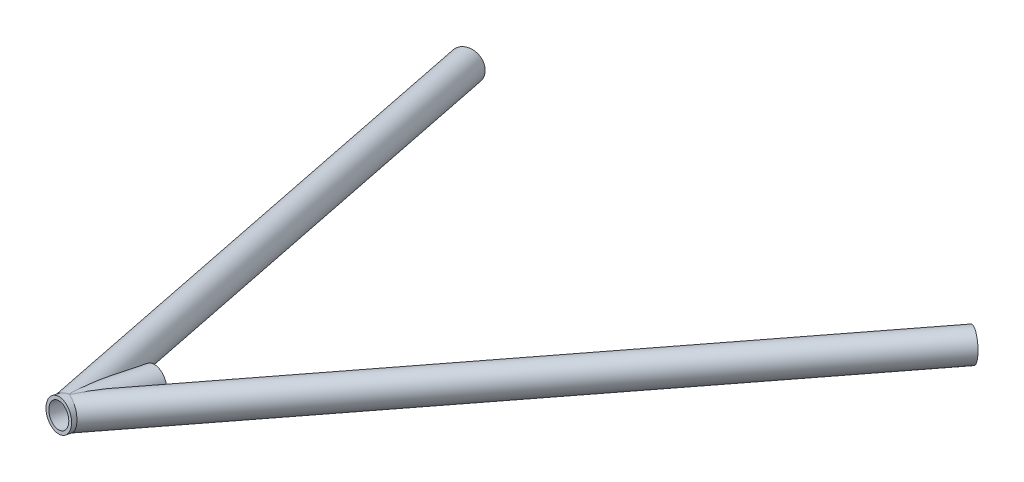
ISO-10303-21;
HEADER;
FILE_DESCRIPTION(('STEP AP214'),'2;1');
FILE_NAME('part.step','',(''),(''),'','','');
FILE_SCHEMA(('AUTOMOTIVE_DESIGN { 1 0 10303 214 1 1 1 1 }'));
ENDSEC;
DATA;
#1=APPLICATION_CONTEXT('core data for automotive mechanical design processes');
#2=APPLICATION_PROTOCOL_DEFINITION('international standard','automotive_design',2000,#1);
#3=PRODUCT_CONTEXT('',#1,'mechanical');
#4=PRODUCT('Part','Part','',(#3));
#5=PRODUCT_RELATED_PRODUCT_CATEGORY('part','',(#4));
#6=PRODUCT_DEFINITION_FORMATION('','',#4);
#7=PRODUCT_DEFINITION_CONTEXT('part definition',#1,'design');
#8=PRODUCT_DEFINITION('design','',#6,#7);
#9=PRODUCT_DEFINITION_SHAPE('','',#8);
#10=(LENGTH_UNIT() NAMED_UNIT(*) SI_UNIT(.MILLI.,.METRE.));
#11=(NAMED_UNIT(*) PLANE_ANGLE_UNIT() SI_UNIT($,.RADIAN.));
#12=(NAMED_UNIT(*) SI_UNIT($,.STERADIAN.) SOLID_ANGLE_UNIT());
#13=UNCERTAINTY_MEASURE_WITH_UNIT(LENGTH_MEASURE(1.E-05),#10,'distance_accuracy_value','');
#14=(GEOMETRIC_REPRESENTATION_CONTEXT(3) GLOBAL_UNCERTAINTY_ASSIGNED_CONTEXT((#13)) GLOBAL_UNIT_ASSIGNED_CONTEXT((#10,
#11,#12)) REPRESENTATION_CONTEXT('',''));
#15=CARTESIAN_POINT('',(0.,0.,0.));
#16=DIRECTION('',(0.,0.,1.));
#17=DIRECTION('',(1.,0.,0.));
#18=AXIS2_PLACEMENT_3D('',#15,#16,#17);
#19=CARTESIAN_POINT('',(1713.17260085528,131.13395858879,611.724588998966));
#20=DIRECTION('',(0.512976736373104,-0.08229223970805,-0.854448860508241));
#21=DIRECTION('',(-0.857356807637054,0.,-0.514722550893585));
#22=AXIS2_PLACEMENT_3D('',#19,#20,#21);
#23=CYLINDRICAL_SURFACE('',#22,7.41679999999994);
#24=CARTESIAN_POINT('',(1932.04581422694,96.022099388704,247.154513007892));
#25=DIRECTION('',(-0.512976736373104,0.0822922397080499,0.854448860508241));
#26=DIRECTION('',(0.857356807637054,0.,0.514722550893586));
#27=AXIS2_PLACEMENT_3D('',#24,#25,#26);
#28=CIRCLE('',#27,7.41679999999994);
#29=CARTESIAN_POINT('',(1938.40465819782,96.022099388704,250.972107223359));
#30=VERTEX_POINT('',#29);
#31=EDGE_CURVE('E109',#30,#30,#28,.T.);
#32=ORIENTED_EDGE('',*,*,#31,.F.);
#33=EDGE_LOOP('',(#32));
#34=FACE_BOUND('',#33,.T.);
#35=CARTESIAN_POINT('',(1727.96494727041,127.740863530205,572.676136847325));
#36=CARTESIAN_POINT('',(1727.97409356128,127.64516894431,572.660902269402));
#37=CARTESIAN_POINT('',(1727.98103211846,127.548097206245,572.652833381433));
#38=CARTESIAN_POINT('',(1727.98986205941,127.353714048548,572.652650921007));
#39=CARTESIAN_POINT('',(1727.9917570845,127.256402852634,572.660525830246));
#40=CARTESIAN_POINT('',(1727.9903865827,127.064536165254,572.692160774698));
#41=CARTESIAN_POINT('',(1727.98712459409,126.96997882967,572.715909912043));
#42=CARTESIAN_POINT('',(1727.97590682349,126.785874735888,572.777508555146));
#43=CARTESIAN_POINT('',(1727.96794614816,126.69633330799,572.81537274554));
#44=CARTESIAN_POINT('',(1727.94374603927,126.485559074002,572.921757086013));
#45=CARTESIAN_POINT('',(1727.92540545642,126.367705556888,572.996436012294));
#46=CARTESIAN_POINT('',(1727.88298827099,126.145253912992,573.162093992202));
#47=CARTESIAN_POINT('',(1727.85889597553,126.040693271732,573.253117468602));
#48=CARTESIAN_POINT('',(1727.80874896439,125.850776346686,573.438738015154));
#49=CARTESIAN_POINT('',(1727.78297627403,125.764568317802,573.532557144889));
#50=CARTESIAN_POINT('',(1727.72900511059,125.600664094481,573.726773439114));
#51=CARTESIAN_POINT('',(1727.70080438425,125.522975962023,573.827176692751));
#52=CARTESIAN_POINT('',(1727.64258111377,125.374671581661,574.032881151348));
#53=CARTESIAN_POINT('',(1727.61255461953,125.304071611508,574.138192852058));
#54=CARTESIAN_POINT('',(1727.55119302126,125.169051291257,574.352237356395));
#55=CARTESIAN_POINT('',(1727.51985847234,125.10462835719,574.460968704016));
#56=CARTESIAN_POINT('',(1727.43550937838,124.940862556696,574.75250380522));
#57=CARTESIAN_POINT('',(1727.38162646562,124.846001418485,574.937569357596));
#58=CARTESIAN_POINT('',(1727.2720160663,124.667387845638,575.312498085115));
#59=CARTESIAN_POINT('',(1727.21628751957,124.583641939115,575.502364002333));
#60=CARTESIAN_POINT('',(1727.10344674438,124.42503329062,575.885807049649));
#61=CARTESIAN_POINT('',(1727.04633202635,124.350188215227,576.079390703019));
#62=CARTESIAN_POINT('',(1726.93118633598,124.208006874476,576.469032465374));
#63=CARTESIAN_POINT('',(1726.87315525579,124.140671500554,576.665090865056));
#64=CARTESIAN_POINT('',(1726.75607151227,124.011958347827,577.060302103558));
#65=CARTESIAN_POINT('',(1726.69701473252,123.950620396564,577.259466620516));
#66=CARTESIAN_POINT('',(1726.57842016781,123.833477246945,577.659275794955));
#67=CARTESIAN_POINT('',(1726.51888236167,123.777672293717,577.859920517589));
#68=CARTESIAN_POINT('',(1726.39955647189,123.670971354545,578.262089610324));
#69=CARTESIAN_POINT('',(1726.33976888635,123.620068255865,578.463612248458));
#70=CARTESIAN_POINT('',(1726.21996664204,123.522526106761,578.867609532447));
#71=CARTESIAN_POINT('',(1726.15995198776,123.475886972416,579.070084159484));
#72=CARTESIAN_POINT('',(1725.97675549558,123.339471254847,579.68863525574));
#73=CARTESIAN_POINT('',(1725.8533478987,123.255762125754,580.105988788057));
#74=CARTESIAN_POINT('',(1725.60651921912,123.101361297342,580.943114963038));
#75=CARTESIAN_POINT('',(1725.48309813691,123.030671398123,581.362887931962));
#76=CARTESIAN_POINT('',(1725.23663397589,122.900298304971,582.204465381431));
#77=CARTESIAN_POINT('',(1725.11359110923,122.840620461465,582.626270747865));
#78=CARTESIAN_POINT('',(1724.86832131163,122.730861979163,583.471367521118));
#79=CARTESIAN_POINT('',(1724.74609440437,122.680781617954,583.894658970559));
#80=CARTESIAN_POINT('',(1724.5023773004,122.58898911596,584.744026957329));
#81=CARTESIAN_POINT('',(1724.38089135839,122.547307849537,585.170108032062));
#82=CARTESIAN_POINT('',(1724.13946845727,122.471741006267,586.023400168488));
#83=CARTESIAN_POINT('',(1724.01953151574,122.437855517866,586.450611242946));
#84=CARTESIAN_POINT('',(1723.78164336913,122.37730603995,587.305929188253));
#85=CARTESIAN_POINT('',(1723.66369146931,122.350639472405,587.734035684142));
#86=CARTESIAN_POINT('',(1723.43017032018,122.304100261973,588.591265690762));
#87=CARTESIAN_POINT('',(1723.31460107086,122.284227619046,589.020389201487));
#88=CARTESIAN_POINT('',(1723.08650301183,122.251038204343,589.879111158263));
#89=CARTESIAN_POINT('',(1722.97397051875,122.237713118719,590.308708304211));
#90=CARTESIAN_POINT('',(1722.75240223065,122.21746804288,591.168958885652));
#91=CARTESIAN_POINT('',(1722.6433664605,122.210548098208,591.599612328634));
#92=CARTESIAN_POINT('',(1722.4294841374,122.203151370928,592.462242442208));
#93=CARTESIAN_POINT('',(1722.32463967907,122.202677770736,592.894219661074));
#94=CARTESIAN_POINT('',(1722.12012673583,122.208397768749,593.759351670043));
#95=CARTESIAN_POINT('',(1722.02045816112,122.214591251234,594.192506439578));
#96=CARTESIAN_POINT('',(1721.82784497984,122.234044047694,595.058398596565));
#97=CARTESIAN_POINT('',(1721.73487583636,122.247275914712,595.49113110808));
#98=CARTESIAN_POINT('',(1721.55672743593,122.281510622887,596.357943907328));
#99=CARTESIAN_POINT('',(1721.47154880266,122.302514085519,596.792024300095));
#100=CARTESIAN_POINT('',(1721.31101479407,122.35340281984,597.661126705699));
#101=CARTESIAN_POINT('',(1721.23565138308,122.383280759445,598.096147648058));
#102=CARTESIAN_POINT('',(1721.09725075453,122.453629781079,598.967260132079));
#103=CARTESIAN_POINT('',(1721.03421072045,122.49409843764,599.40335140599));
#104=CARTESIAN_POINT('',(1720.95141843917,122.564800761776,600.058504181435));
#105=CARTESIAN_POINT('',(1720.92575512113,122.590076478741,600.27735975769));
#106=CARTESIAN_POINT('',(1720.87894799292,122.644429538069,600.715097811308));
#107=CARTESIAN_POINT('',(1720.85780430852,122.673506986186,600.933980289252));
#108=CARTESIAN_POINT('',(1720.82063639031,122.736046756599,601.37177018042));
#109=CARTESIAN_POINT('',(1720.80461691278,122.769513112292,601.590677429229));
#110=CARTESIAN_POINT('',(1720.77843177853,122.841500800809,602.0280190367));
#111=CARTESIAN_POINT('',(1720.76826600443,122.880022032265,602.246453404756));
#112=CARTESIAN_POINT('',(1720.75464236975,122.962578180945,602.680391994006));
#113=CARTESIAN_POINT('',(1720.75112283815,123.006558329871,602.895904544071));
#114=CARTESIAN_POINT('',(1720.75144146033,123.101309930987,603.32547198744));
#115=CARTESIAN_POINT('',(1720.75528034475,123.152082057095,603.539526733878));
#116=CARTESIAN_POINT('',(1720.77117314224,123.261516067903,603.964991352626));
#117=CARTESIAN_POINT('',(1720.78321484223,123.320166119178,604.176404681827));
#118=CARTESIAN_POINT('',(1720.81632130453,123.44675439699,604.595673975282));
#119=CARTESIAN_POINT('',(1720.83738269157,123.514689142633,604.803531240023));
#120=CARTESIAN_POINT('',(1720.88654176997,123.653870902915,605.193228073523));
#121=CARTESIAN_POINT('',(1720.91370135907,123.724071338384,605.375557052368));
#122=CARTESIAN_POINT('',(1720.97607889913,123.874300330305,605.734729463356));
#123=CARTESIAN_POINT('',(1721.01129627704,123.954328187649,605.911573284585));
#124=CARTESIAN_POINT('',(1721.08971062154,124.125271923741,606.258131687802));
#125=CARTESIAN_POINT('',(1721.13290784645,124.216188154927,606.427846038781));
#126=CARTESIAN_POINT('',(1721.22674446288,124.409769775465,606.758314823208));
#127=CARTESIAN_POINT('',(1721.27738376908,124.512435030114,606.919069359348));
#128=CARTESIAN_POINT('',(1721.3855072529,124.730994984514,607.23111948081));
#129=CARTESIAN_POINT('',(1721.44304636173,124.846995500896,607.382322217059));
#130=CARTESIAN_POINT('',(1721.56300771482,125.091639689068,607.67205382739));
#131=CARTESIAN_POINT('',(1721.62542999899,125.220283464155,607.810582597906));
#132=CARTESIAN_POINT('',(1721.75315143352,125.489914923755,608.073651978261));
#133=CARTESIAN_POINT('',(1721.81845111264,125.630904881767,608.19819000208));
#134=CARTESIAN_POINT('',(1721.94968124855,125.924479370239,608.432366170017));
#135=CARTESIAN_POINT('',(1722.01561167772,126.077063394983,608.542004963434));
#136=CARTESIAN_POINT('',(1722.13955526978,126.377509450479,608.736096590528));
#137=CARTESIAN_POINT('',(1722.19771779669,126.524402700009,608.821959461154));
#138=CARTESIAN_POINT('',(1722.31116511023,126.825880386425,608.981134975396));
#139=CARTESIAN_POINT('',(1722.3664501127,126.980464244723,609.054448561295));
#140=CARTESIAN_POINT('',(1722.47275540199,127.296365032461,609.188669150145));
#141=CARTESIAN_POINT('',(1722.5237749461,127.457683127195,609.249573995075));
#142=CARTESIAN_POINT('',(1722.62033165225,127.785999443879,609.359205215786));
#143=CARTESIAN_POINT('',(1722.66586857487,127.952997913477,609.407931059826));
#144=CARTESIAN_POINT('',(1722.75164172524,128.29640418743,609.494706477049));
#145=CARTESIAN_POINT('',(1722.79169181994,128.472944530114,609.532415478967));
#146=CARTESIAN_POINT('',(1722.8640371505,128.829759443344,609.595601504443));
#147=CARTESIAN_POINT('',(1722.89633232043,129.010034045622,609.621078424016));
#148=CARTESIAN_POINT('',(1722.95249148233,129.373186473069,609.660119630804));
#149=CARTESIAN_POINT('',(1722.97635454316,129.556064583422,609.673682602619));
#150=CARTESIAN_POINT('',(1723.01515818182,129.923256038395,609.689169544628));
#151=CARTESIAN_POINT('',(1723.03009848552,130.107569426933,609.691093157246));
#152=CARTESIAN_POINT('',(1723.05126111044,130.48562374927,609.68334006981));
#153=CARTESIAN_POINT('',(1723.05701489795,130.679379398514,609.673083994552));
#154=CARTESIAN_POINT('',(1723.05820730972,131.065873045047,609.640194907813));
#155=CARTESIAN_POINT('',(1723.05364558616,131.258611007804,609.617561479028));
#156=CARTESIAN_POINT('',(1723.0342649561,131.641770012805,609.560034321559));
#157=CARTESIAN_POINT('',(1723.01944390483,131.832190562108,609.525138030002));
#158=CARTESIAN_POINT('',(1722.97981103516,132.209328386555,609.443138314178));
#159=CARTESIAN_POINT('',(1722.95499922456,132.39604566459,609.396034899443));
#160=CARTESIAN_POINT('',(1722.89550269088,132.766703219176,609.288949001972));
#161=CARTESIAN_POINT('',(1722.86069983807,132.950580734236,609.22881466779));
#162=CARTESIAN_POINT('',(1722.78208849335,133.311748866658,609.095948257574));
#163=CARTESIAN_POINT('',(1722.73827986116,133.489039381357,609.023215985292));
#164=CARTESIAN_POINT('',(1722.64265698482,133.83559948493,608.865054832965));
#165=CARTESIAN_POINT('',(1722.59084362106,134.004869953218,608.779627349244));
#166=CARTESIAN_POINT('',(1722.48047464414,134.33400566275,608.595962018572));
#167=CARTESIAN_POINT('',(1722.4219192384,134.493871193108,608.497724565708));
#168=CARTESIAN_POINT('',(1722.30106472921,134.799174643532,608.290864804495));
#169=CARTESIAN_POINT('',(1722.23888720345,134.94486466322,608.18254370868));
#170=CARTESIAN_POINT('',(1722.11127512067,135.224795212031,607.953702361441));
#171=CARTESIAN_POINT('',(1722.04584064459,135.359036025404,607.833182413039));
#172=CARTESIAN_POINT('',(1721.91366635636,135.614930784771,607.580298333684));
#173=CARTESIAN_POINT('',(1721.84692756972,135.736594180956,607.447943236731));
#174=CARTESIAN_POINT('',(1721.71412450417,135.966639285091,607.171847178467));
#175=CARTESIAN_POINT('',(1721.64806018694,136.075021751086,607.02810686777));
#176=CARTESIAN_POINT('',(1721.52239851466,136.272116972746,606.738790542243));
#177=CARTESIAN_POINT('',(1721.46264865977,136.361607971169,606.593809785904));
#178=CARTESIAN_POINT('',(1721.34708030177,136.528344058238,606.295479899512));
#179=CARTESIAN_POINT('',(1721.29126195926,136.605588646783,606.142130428052));
#180=CARTESIAN_POINT('',(1721.18487097998,136.748087082032,605.828289022178));
#181=CARTESIAN_POINT('',(1721.1342967204,136.813344643017,605.667799319437));
#182=CARTESIAN_POINT('',(1721.0393136034,136.93250954249,605.340898347557));
#183=CARTESIAN_POINT('',(1720.99490558263,136.986415341279,605.174486278711));
#184=CARTESIAN_POINT('',(1720.89775755889,137.101612192386,604.774949400739));
#185=CARTESIAN_POINT('',(1720.84795468422,137.158334953547,604.539786197404));
#186=CARTESIAN_POINT('',(1720.761417646,137.254742564386,604.063646261449));
#187=CARTESIAN_POINT('',(1720.72468903258,137.294420179742,603.822667106151));
#188=CARTESIAN_POINT('',(1720.66371663303,137.359538683433,603.336541202226));
#189=CARTESIAN_POINT('',(1720.63951103582,137.384936044358,603.091384033362));
#190=CARTESIAN_POINT('',(1720.60272339149,137.423819425911,602.599355883453));
#191=CARTESIAN_POINT('',(1720.59013996661,137.437306858397,602.352485109045));
#192=CARTESIAN_POINT('',(1720.57337385512,137.456823568455,601.792628043288));
#193=CARTESIAN_POINT('',(1720.57230027565,137.459930016163,601.479454378519));
#194=CARTESIAN_POINT('',(1720.58417742968,137.454018409565,600.853430304954));
#195=CARTESIAN_POINT('',(1720.59713493855,137.444994497211,600.540580125412));
#196=CARTESIAN_POINT('',(1720.63480918709,137.417352784856,599.915485161843));
#197=CARTESIAN_POINT('',(1720.65954724853,137.398717584163,599.603242510398));
#198=CARTESIAN_POINT('',(1720.71882165563,137.353738420371,598.980328897369));
#199=CARTESIAN_POINT('',(1720.75335646173,137.327395668486,598.669657696635));
#200=CARTESIAN_POINT('',(1720.8308046662,137.268223698417,598.048368225909));
#201=CARTESIAN_POINT('',(1720.87376015575,137.235361884093,597.737758410564));
#202=CARTESIAN_POINT('',(1720.96659709961,137.164253235441,597.118199275331));
#203=CARTESIAN_POINT('',(1721.01647876114,137.126006240001,596.80925000541));
#204=CARTESIAN_POINT('',(1721.12202554296,137.04490868398,596.193280763136));
#205=CARTESIAN_POINT('',(1721.17768482224,137.002062771319,595.886259168724));
#206=CARTESIAN_POINT('',(1721.29394637719,136.91227202674,595.273753004626));
#207=CARTESIAN_POINT('',(1721.35454879116,136.86532708014,594.968268478198));
#208=CARTESIAN_POINT('',(1721.48689814169,136.762340022273,594.325092282613));
#209=CARTESIAN_POINT('',(1721.55913661087,136.705865864814,593.987571240588));
#210=CARTESIAN_POINT('',(1721.70800797088,136.588721327278,593.314235690565));
#211=CARTESIAN_POINT('',(1721.78464089753,136.528050913001,592.978421196498));
#212=CARTESIAN_POINT('',(1722.02015110959,136.340118035014,591.973243681679));
#213=CARTESIAN_POINT('',(1722.18461125852,136.206955959258,591.306282617483));
#214=CARTESIAN_POINT('',(1722.52380469313,135.926387101613,589.980768374029));
#215=CARTESIAN_POINT('',(1722.69849782608,135.779034703202,589.322193249398));
#216=CARTESIAN_POINT('',(1723.05598721481,135.469567694324,588.01080760164));
#217=CARTESIAN_POINT('',(1723.23878260921,135.307454651191,587.357996474529));
#218=CARTESIAN_POINT('',(1723.55452426619,135.018691715748,586.253930224215));
#219=CARTESIAN_POINT('',(1723.68590746506,134.896061424993,585.801171825454));
#220=CARTESIAN_POINT('',(1723.95111551043,134.642547833543,584.898691759351));
#221=CARTESIAN_POINT('',(1724.08494031998,134.511664657721,584.448970046175));
#222=CARTESIAN_POINT('',(1724.35467562746,134.240717304903,583.552415100005));
#223=CARTESIAN_POINT('',(1724.49058800813,134.100644416195,583.105585062221));
#224=CARTESIAN_POINT('',(1724.76392276377,133.810333225487,582.215709012982));
#225=CARTESIAN_POINT('',(1724.90134507992,133.660095318334,581.772662855299));
#226=CARTESIAN_POINT('',(1725.13303411532,133.39795288106,581.032344486458));
#227=CARTESIAN_POINT('',(1725.22701445816,133.28919715999,580.733866737919));
#228=CARTESIAN_POINT('',(1725.41531632578,133.065645250542,580.139292497245));
#229=CARTESIAN_POINT('',(1725.50963784152,132.95084922093,579.843195942756));
#230=CARTESIAN_POINT('',(1725.69835005293,132.714542685856,579.25412563389));
#231=CARTESIAN_POINT('',(1725.79274055542,132.593039779193,578.961148776507));
#232=CARTESIAN_POINT('',(1725.98149054865,132.342170423669,578.378573935822));
#233=CARTESIAN_POINT('',(1726.07585004089,132.212804440137,578.088975753778));
#234=CARTESIAN_POINT('',(1726.23385918959,131.988073989553,577.606814129099));
#235=CARTESIAN_POINT('',(1726.29758828677,131.895216124959,577.413108274243));
#236=CARTESIAN_POINT('',(1726.4248037404,131.704690541732,577.027999567039));
#237=CARTESIAN_POINT('',(1726.48829010775,131.607023041657,576.836596610536));
#238=CARTESIAN_POINT('',(1726.61505615117,131.405902201767,576.456054624089));
#239=CARTESIAN_POINT('',(1726.67833480281,131.302433918203,576.266923123393));
#240=CARTESIAN_POINT('',(1726.80431567271,131.089057563296,575.892150690148));
#241=CARTESIAN_POINT('',(1726.867017965,130.979150332607,575.706509306099));
#242=CARTESIAN_POINT('',(1726.99211645082,130.750728030525,575.338096019851));
#243=CARTESIAN_POINT('',(1727.05450552396,130.632147790679,575.155361869542));
#244=CARTESIAN_POINT('',(1727.17801168559,130.385601539973,574.795908283368));
#245=CARTESIAN_POINT('',(1727.23912910397,130.257638003225,574.619187279869));
#246=CARTESIAN_POINT('',(1727.35926148651,129.990467359075,574.274593833891));
#247=CARTESIAN_POINT('',(1727.41828252617,129.851297354702,574.10669500518));
#248=CARTESIAN_POINT('',(1727.53327019244,129.558384804784,573.783152562983));
#249=CARTESIAN_POINT('',(1727.58924141535,129.404665200731,573.627490341884));
#250=CARTESIAN_POINT('',(1727.68314433537,129.117876197078,573.370777447723));
#251=CARTESIAN_POINT('',(1727.72215557023,128.988860016176,573.26564562207));
#252=CARTESIAN_POINT('',(1727.79564740224,128.717655455677,573.071767362935));
#253=CARTESIAN_POINT('',(1727.83013371945,128.575484101463,572.983000183799));
#254=CARTESIAN_POINT('',(1727.88309047912,128.318771701563,572.852247853479));
#255=CARTESIAN_POINT('',(1727.90333274577,128.20777788541,572.804131380463));
#256=CARTESIAN_POINT('',(1727.93851685935,127.978856234307,572.72565361665));
#257=CARTESIAN_POINT('',(1727.95347021606,127.860944115686,572.695253676343));
#258=CARTESIAN_POINT('',(1727.96494727041,127.740863530205,572.676136847325));
#259=B_SPLINE_CURVE_WITH_KNOTS('',3,(#35,#36,#37,#38,#39,#40,#41,#42,#43,#44,#45,#46,#47,#48,
#49,#50,#51,#52,#53,#54,#55,#56,#57,#58,#59,#60,#61,#62,#63,#64,#65,#66,#67,#68,#69,#70,#71,#72,
#73,#74,#75,#76,#77,#78,#79,#80,#81,#82,#83,#84,#85,#86,#87,#88,#89,#90,#91,#92,#93,#94,#95,#96,
#97,#98,#99,#100,#101,#102,#103,#104,#105,#106,#107,#108,#109,#110,#111,#112,#113,#114,#115,
#116,#117,#118,#119,#120,#121,#122,#123,#124,#125,#126,#127,#128,#129,#130,#131,#132,#133,#134,
#135,#136,#137,#138,#139,#140,#141,#142,#143,#144,#145,#146,#147,#148,#149,#150,#151,#152,#153,
#154,#155,#156,#157,#158,#159,#160,#161,#162,#163,#164,#165,#166,#167,#168,#169,#170,#171,#172,
#173,#174,#175,#176,#177,#178,#179,#180,#181,#182,#183,#184,#185,#186,#187,#188,#189,#190,#191,
#192,#193,#194,#195,#196,#197,#198,#199,#200,#201,#202,#203,#204,#205,#206,#207,#208,#209,#210,
#211,#212,#213,#214,#215,#216,#217,#218,#219,#220,#221,#222,#223,#224,#225,#226,#227,#228,#229,
#230,#231,#232,#233,#234,#235,#236,#237,#238,#239,#240,#241,#242,#243,#244,#245,#246,#247,#248,
#249,#250,#251,#252,#253,#254,#255,#256,#257,#258),.UNSPECIFIED.,.T.,.F.,(4,2,2,2,2,2,2,2,2,2,2,
2,2,2,2,2,2,2,2,2,2,2,2,2,2,2,2,2,2,2,2,2,2,2,2,2,2,2,2,2,2,2,2,2,2,2,2,2,2,2,2,2,2,2,2,2,2,2,2,
2,2,2,2,2,2,2,2,2,2,2,2,2,2,2,2,2,2,2,2,2,2,2,2,2,2,2,2,2,2,2,2,2,2,2,2,2,2,2,2,2,2,2,2,2,2,2,2,
2,2,2,2,4),(0.,0.291656591218855,0.583102555640827,0.87434864375699,1.16589858006724,
1.5856578834552,2.00657580956693,2.39597589617774,2.78574133110556,3.17638230524677,
3.56685914740464,4.21083369398615,4.85518479688032,5.50079420094327,6.14648016047722,
6.79619807535992,7.44594476172044,8.09473397282771,8.74351041212596,10.0728164311257,
11.4023061086014,12.7324400540744,14.0626124648872,15.3975886924638,16.7325800649132,
18.0670940527303,19.4016080328567,20.7344230889432,22.0672476221921,23.4007301175251,
24.7341894682326,26.0624865637217,27.390889902896,28.7181987552896,30.0452038952401,
30.7105409766526,31.3758965697791,32.0418679651432,32.7078260073738,33.3675736123946,
34.0273867279434,34.6862195967952,35.3448061388811,35.9361426842286,36.5274371870364,
37.1187508342409,37.7100577027442,38.306431067104,38.9028093042808,39.4992975940149,
40.0957598807923,40.6345779252884,41.1733554939511,41.712226682339,42.2511213940096,
42.8052431052792,43.3593695271133,43.913557121494,44.4677617411174,45.0494204713949,
45.6310988136173,46.2128987958999,46.7946983239421,47.3836820475387,47.9726749469791,
48.5616031119762,49.1505131634281,49.7254694740632,50.3004115060981,50.8749183599962,
51.4493924070681,51.9903845216299,52.5313987227882,53.0722450022913,53.6131645923983,
54.3529066416226,55.0929623436864,55.8352617360778,56.5774731210975,57.5163331156722,
58.4556466717029,59.3966668023599,60.3375391343051,61.2832402340867,62.2289696330675,
63.1737520684949,64.1185609450706,65.1677571232543,66.2169618530206,68.315793175217,
70.4068787946167,72.4977426342074,73.9590409263611,75.4203171128225,76.8829991637273,
78.3456244311909,79.3394232765677,80.3331960137288,81.3258650514062,82.3184754009144,
82.9906234829013,83.6627410495362,84.336677677075,85.0105265122617,85.6900973245055,
86.3694895928182,87.0467183255271,87.7228964646583,88.2348355184021,88.7461210498792,
89.1129041224166,89.4788840146468),.UNSPECIFIED.);
#260=CARTESIAN_POINT('',(1727.96494727041,127.740863530205,572.676136847325));
#261=VERTEX_POINT('',#260);
#262=EDGE_CURVE('E83',#261,#261,#259,.T.);
#263=ORIENTED_EDGE('',*,*,#262,.T.);
#264=EDGE_LOOP('',(#263));
#265=FACE_BOUND('',#264,.T.);
#266=ADVANCED_FACE('F65',(#34,#265),#23,.F.);
#267=CARTESIAN_POINT('',(1719.75176820433,126.102654339161,562.415355233465));
#268=DIRECTION('',(-0.131583346980973,0.100626084992588,0.98618467531003));
#269=DIRECTION('',(0.991215775128284,0.,0.132254629925897));
#270=AXIS2_PLACEMENT_3D('',#267,#268,#269);
#271=CYLINDRICAL_SURFACE('',#270,9.525);
#272=ORIENTED_EDGE('',*,*,#262,.F.);
#273=EDGE_LOOP('',(#272));
#274=FACE_BOUND('',#273,.T.);
#275=CARTESIAN_POINT('',(1713.17260085528,131.13395858879,611.724588998965));
#276=DIRECTION('',(0.944230002344393,0.0453897924229676,0.326143326493902));
#277=DIRECTION('',(0.329060742994004,-0.0933834430453637,-0.93968003064087));
#278=AXIS2_PLACEMENT_3D('',#275,#276,#277);
#279=ELLIPSE('',#278,47.1628036692756,9.52499999999997);
#280=CARTESIAN_POINT('',(1713.05643876749,140.607476372162,610.742452461864));
#281=VERTEX_POINT('',#280);
#282=CARTESIAN_POINT('',(1713.28876294306,121.660440805419,612.706725536066));
#283=VERTEX_POINT('',#282);
#284=EDGE_CURVE('E74',#281,#283,#279,.F.);
#285=ORIENTED_EDGE('',*,*,#284,.T.);
#286=CARTESIAN_POINT('',(1713.17260085528,131.13395858879,611.724588998965));
#287=DIRECTION('',(0.329060742994004,-0.0933834430453637,-0.93968003064087));
#288=DIRECTION('',(0.944230002344393,0.0453897924229676,0.326143326493902));
#289=AXIS2_PLACEMENT_3D('',#286,#287,#288);
#290=ELLIPSE('',#289,9.72540390868762,9.52499999999997);
#291=EDGE_CURVE('E13',#283,#281,#290,.F.);
#292=ORIENTED_EDGE('',*,*,#291,.T.);
#293=EDGE_LOOP('',(#285,#292));
#294=FACE_BOUND('',#293,.T.);
#295=ADVANCED_FACE('F81',(#274,#294),#271,.F.);
#296=CARTESIAN_POINT('',(1713.17260085528,131.13395858879,611.724588998966));
#297=DIRECTION('',(0.512976736373104,-0.08229223970805,-0.854448860508241));
#298=DIRECTION('',(-0.857356807637054,0.,-0.514722550893585));
#299=AXIS2_PLACEMENT_3D('',#296,#297,#298);
#300=CYLINDRICAL_SURFACE('',#299,9.52499999999993);
#301=CARTESIAN_POINT('',(1932.04581422694,96.022099388704,247.154513007892));
#302=DIRECTION('',(-0.512976736373104,0.0822922397080499,0.854448860508241));
#303=DIRECTION('',(0.857356807637054,0.,0.514722550893586));
#304=AXIS2_PLACEMENT_3D('',#301,#302,#303);
#305=CIRCLE('',#304,9.52499999999993);
#306=CARTESIAN_POINT('',(1940.21213781968,96.022099388704,252.057245305153));
#307=VERTEX_POINT('',#306);
#308=EDGE_CURVE('E69',#307,#307,#305,.T.);
#309=ORIENTED_EDGE('',*,*,#308,.T.);
#310=EDGE_LOOP('',(#309));
#311=FACE_BOUND('',#310,.T.);
#312=ORIENTED_EDGE('',*,*,#284,.F.);
#313=ORIENTED_EDGE('',*,*,#291,.F.);
#314=EDGE_LOOP('',(#312,#313));
#315=FACE_BOUND('',#314,.T.);
#316=ADVANCED_FACE('F67',(#311,#315),#300,.T.);
#317=CARTESIAN_POINT('',(1932.04581422694,96.022099388704,247.154513007892));
#318=DIRECTION('',(-0.512976736373104,0.0822922397080499,0.854448860508241));
#319=DIRECTION('',(0.857356807637054,0.,0.514722550893586));
#320=AXIS2_PLACEMENT_3D('',#317,#318,#319);
#321=PLANE('',#320);
#322=ORIENTED_EDGE('',*,*,#31,.T.);
#323=EDGE_LOOP('',(#322));
#324=FACE_BOUND('',#323,.T.);
#325=ORIENTED_EDGE('',*,*,#308,.F.);
#326=EDGE_LOOP('',(#325));
#327=FACE_BOUND('',#326,.T.);
#328=ADVANCED_FACE('F86',(#324,#327),#321,.F.);
#329=CLOSED_SHELL('',(#266,#295,#316,#328));
#330=MANIFOLD_SOLID_BREP('B2',#329);
#331=CARTESIAN_POINT('',(1600.,88.8502518080076,217.248802890104));
#332=DIRECTION('',(0.274316838299431,0.102490644096067,0.956162088820811));
#333=DIRECTION('',(0.961223924389069,0.,-0.275769046816492));
#334=AXIS2_PLACEMENT_3D('',#331,#332,#333);
#335=CYLINDRICAL_SURFACE('',#334,7.41679999999994);
#336=CARTESIAN_POINT('',(1609.60108934048,92.43742435137,250.714475998833));
#337=DIRECTION('',(0.274316838299431,0.102490644096068,0.956162088820811));
#338=DIRECTION('',(0.96122392438907,0.,-0.275769046816492));
#339=AXIS2_PLACEMENT_3D('',#336,#337,#338);
#340=CIRCLE('',#339,7.41679999999994);
#341=CARTESIAN_POINT('',(1616.73029494289,92.43742435137,248.669152132404));
#342=VERTEX_POINT('',#341);
#343=EDGE_CURVE('E184',#342,#342,#340,.T.);
#344=ORIENTED_EDGE('',*,*,#343,.F.);
#345=EDGE_LOOP('',(#344));
#346=FACE_BOUND('',#345,.T.);
#347=CARTESIAN_POINT('',(1709.06350498049,126.935088537342,570.506905601688));
#348=CARTESIAN_POINT('',(1709.06255294939,127.044087690915,570.503591947602));
#349=CARTESIAN_POINT('',(1709.06210544559,127.153423526844,570.510808036362));
#350=CARTESIAN_POINT('',(1709.06214305419,127.3691639084,570.544250855181));
#351=CARTESIAN_POINT('',(1709.06262991493,127.475562580256,570.570513166284));
#352=CARTESIAN_POINT('',(1709.06469977815,127.722014388532,570.65118024678));
#353=CARTESIAN_POINT('',(1709.06662456253,127.859776377144,570.712435957904));
#354=CARTESIAN_POINT('',(1709.07149010629,128.124282710594,570.855157677084));
#355=CARTESIAN_POINT('',(1709.07443334234,128.25099924581,570.936672814765));
#356=CARTESIAN_POINT('',(1709.08087011885,128.489175845386,571.109810217326));
#357=CARTESIAN_POINT('',(1709.08433587729,128.601050069092,571.200875292237));
#358=CARTESIAN_POINT('',(1709.09170794719,128.816794076298,571.39210633078));
#359=CARTESIAN_POINT('',(1709.09561469405,128.92065577575,571.492281269256));
#360=CARTESIAN_POINT('',(1709.10374410881,129.121738028066,571.699507529599));
#361=CARTESIAN_POINT('',(1709.10796755147,129.218941102107,571.806575618093));
#362=CARTESIAN_POINT('',(1709.11662832225,129.407398445323,572.025690068846));
#363=CARTESIAN_POINT('',(1709.12106555107,129.498655430406,572.137734118419));
#364=CARTESIAN_POINT('',(1709.13335362214,129.740336974716,572.448175424802));
#365=CARTESIAN_POINT('',(1709.14135208081,129.885813797925,572.650413238847));
#366=CARTESIAN_POINT('',(1709.15757186825,130.165104494953,573.062833072702));
#367=CARTESIAN_POINT('',(1709.16579332973,130.298911214796,573.273019853764));
#368=CARTESIAN_POINT('',(1709.18233172725,130.557271722533,573.699539466838));
#369=CARTESIAN_POINT('',(1709.19064881981,130.681806711654,573.915883618693));
#370=CARTESIAN_POINT('',(1709.20726295485,130.922971223934,574.352940978976));
#371=CARTESIAN_POINT('',(1709.21555999488,131.039599817308,574.573654697332));
#372=CARTESIAN_POINT('',(1709.23209942495,131.266716282858,575.01961346927));
#373=CARTESIAN_POINT('',(1709.24034132774,131.377170187306,575.244875771922));
#374=CARTESIAN_POINT('',(1709.25666645807,131.59223568389,575.698181111083));
#375=CARTESIAN_POINT('',(1709.26474967823,131.69684700532,575.926224275844));
#376=CARTESIAN_POINT('',(1709.28069399071,131.900815623402,576.384294277709));
#377=CARTESIAN_POINT('',(1709.28855535839,132.000179579784,576.614318147394));
#378=CARTESIAN_POINT('',(1709.30401965397,132.194371047811,577.076274498432));
#379=CARTESIAN_POINT('',(1709.31162258369,132.28919859116,577.308206966433));
#380=CARTESIAN_POINT('',(1709.32889964164,132.504344048182,577.847839342296));
#381=CARTESIAN_POINT('',(1709.33846211915,132.623160254534,578.156141633026));
#382=CARTESIAN_POINT('',(1709.35696306721,132.854561437848,578.77509907653));
#383=CARTESIAN_POINT('',(1709.3659015102,132.967146139598,579.085754332533));
#384=CARTESIAN_POINT('',(1709.39163720804,133.296602206956,580.020778766972));
#385=CARTESIAN_POINT('',(1709.4073520924,133.505142480247,580.64812250019));
#386=CARTESIAN_POINT('',(1709.43506389014,133.904010408966,581.909510342598));
#387=CARTESIAN_POINT('',(1709.44705587271,134.09431368178,582.543562197447));
#388=CARTESIAN_POINT('',(1709.46627478986,134.458749251554,583.816297644709));
#389=CARTESIAN_POINT('',(1709.47350215179,134.632882997559,584.454980816541));
#390=CARTESIAN_POINT('',(1709.48189036759,134.965916585917,585.734068648147));
#391=CARTESIAN_POINT('',(1709.48307133795,135.124865214895,586.374460497877));
#392=CARTESIAN_POINT('',(1709.47774464217,135.428924112687,587.658539990947));
#393=CARTESIAN_POINT('',(1709.47123646437,135.574033459913,588.302227850771));
#394=CARTESIAN_POINT('',(1709.44826322381,135.850293853537,589.59179398585));
#395=CARTESIAN_POINT('',(1709.43180751393,135.981457875596,590.237669637556));
#396=CARTESIAN_POINT('',(1709.38580003499,136.22915818263,591.531712589971));
#397=CARTESIAN_POINT('',(1709.35625007072,136.345696480639,592.179879562657));
#398=CARTESIAN_POINT('',(1709.29081179958,136.530079213882,593.286166942272));
#399=CARTESIAN_POINT('',(1709.25937726659,136.602136122396,593.743844087317));
#400=CARTESIAN_POINT('',(1709.1854876718,136.736619824262,594.659832719665));
#401=CARTESIAN_POINT('',(1709.14303066,136.79904491052,595.118144304924));
#402=CARTESIAN_POINT('',(1709.04416569582,136.912213467283,596.034978200336));
#403=CARTESIAN_POINT('',(1708.9877522148,136.962952293032,596.493500521948));
#404=CARTESIAN_POINT('',(1708.88975099101,137.027744884094,597.180391632134));
#405=CARTESIAN_POINT('',(1708.85485739247,137.047455241833,597.409186600545));
#406=CARTESIAN_POINT('',(1708.77999936976,137.082498542064,597.866275824807));
#407=CARTESIAN_POINT('',(1708.74003522767,137.0978317279,598.094570107792));
#408=CARTESIAN_POINT('',(1708.64036473044,137.127579178516,598.624903221333));
#409=CARTESIAN_POINT('',(1708.57847544494,137.140054340062,598.9266517696));
#410=CARTESIAN_POINT('',(1708.44281982156,137.153788818515,599.527835169082));
#411=CARTESIAN_POINT('',(1708.36905158462,137.155046340267,599.827269642315));
#412=CARTESIAN_POINT('',(1708.20791333706,137.143338259056,600.421624012675));
#413=CARTESIAN_POINT('',(1708.12057027134,137.130400530668,600.716551608552));
#414=CARTESIAN_POINT('',(1707.93044339718,137.086441312372,601.300025221551));
#415=CARTESIAN_POINT('',(1707.82766804035,137.055429694152,601.588574633115));
#416=CARTESIAN_POINT('',(1707.64328569579,136.984920253529,602.059749571055));
#417=CARTESIAN_POINT('',(1707.56629997066,136.951854799591,602.245148247322));
#418=CARTESIAN_POINT('',(1707.4052274429,136.874200624648,602.610338700682));
#419=CARTESIAN_POINT('',(1707.32114311375,136.82961590643,602.790132401155));
#420=CARTESIAN_POINT('',(1707.14643921547,136.727474374723,603.14251328874));
#421=CARTESIAN_POINT('',(1707.05582669949,136.66993142272,603.315107944583));
#422=CARTESIAN_POINT('',(1706.86903107642,136.540530396036,603.65174228537));
#423=CARTESIAN_POINT('',(1706.77284809823,136.46867265249,603.815782168095));
#424=CARTESIAN_POINT('',(1706.5755691397,136.308905103992,604.135399092814));
#425=CARTESIAN_POINT('',(1706.47443409809,136.220844157524,604.290876859844));
#426=CARTESIAN_POINT('',(1706.27034599279,136.02870216644,604.590343745205));
#427=CARTESIAN_POINT('',(1706.16739288982,135.924620775313,604.734332614937));
#428=CARTESIAN_POINT('',(1705.96217949654,135.700549717034,605.010023955433));
#429=CARTESIAN_POINT('',(1705.85991950627,135.580553572027,605.141721385769));
#430=CARTESIAN_POINT('',(1705.65878423169,135.325394362455,605.392374978266));
#431=CARTESIAN_POINT('',(1705.55990871974,135.190232320627,605.511331998542));
#432=CARTESIAN_POINT('',(1705.38006379439,134.923688800436,605.722439684072));
#433=CARTESIAN_POINT('',(1705.29840156879,134.793948948376,605.81608221586));
#434=CARTESIAN_POINT('',(1705.14109921915,134.524689527066,605.993845043834));
#435=CARTESIAN_POINT('',(1705.06545846979,134.385170976182,606.077966329197));
#436=CARTESIAN_POINT('',(1704.92149674826,134.097377315959,606.237002091626));
#437=CARTESIAN_POINT('',(1704.8531763516,133.949101519578,606.311915844898));
#438=CARTESIAN_POINT('',(1704.72495538455,133.644889031478,606.45287565571));
#439=CARTESIAN_POINT('',(1704.66505525417,133.488951940001,606.518921249846));
#440=CARTESIAN_POINT('',(1704.55276314968,133.165313822753,606.64449799809));
#441=CARTESIAN_POINT('',(1704.50068152781,132.997394751521,606.703744763815));
#442=CARTESIAN_POINT('',(1704.40723664502,132.655804601361,606.813444535391));
#443=CARTESIAN_POINT('',(1704.36587349178,132.482133464666,606.863897452896));
#444=CARTESIAN_POINT('',(1704.29444518128,132.130233332398,606.956255522036));
#445=CARTESIAN_POINT('',(1704.26438136299,131.952003799328,606.998159660377));
#446=CARTESIAN_POINT('',(1704.2159669121,131.592205916582,607.073563971884));
#447=CARTESIAN_POINT('',(1704.19761662898,131.410637467454,607.107063894284));
#448=CARTESIAN_POINT('',(1704.17227296706,131.036406309847,607.167148495296));
#449=CARTESIAN_POINT('',(1704.16587915398,130.843635429563,607.193314654517));
#450=CARTESIAN_POINT('',(1704.16635844258,130.457075704539,607.236401786006));
#451=CARTESIAN_POINT('',(1704.17323199085,130.263286825751,607.253322447048));
#452=CARTESIAN_POINT('',(1704.20017135363,129.875988768252,607.277739229447));
#453=CARTESIAN_POINT('',(1704.22024000917,129.682479658771,607.285233320164));
#454=CARTESIAN_POINT('',(1704.27331027896,129.297108939081,607.29048561702));
#455=CARTESIAN_POINT('',(1704.30631187309,129.105247326308,607.288243838313));
#456=CARTESIAN_POINT('',(1704.38523499487,128.722342660874,607.273517323067));
#457=CARTESIAN_POINT('',(1704.43129750427,128.531333019112,607.26091779662));
#458=CARTESIAN_POINT('',(1704.53549747284,128.153685587694,607.224772132334));
#459=CARTESIAN_POINT('',(1704.59363511356,127.96704786382,607.201225829895));
#460=CARTESIAN_POINT('',(1704.72104946367,127.599506580854,607.142534461137));
#461=CARTESIAN_POINT('',(1704.79032473449,127.418602284821,607.107390892143));
#462=CARTESIAN_POINT('',(1704.93882518666,127.063823418233,607.024782512783));
#463=CARTESIAN_POINT('',(1705.01805004685,126.889948621015,606.977318100063));
#464=CARTESIAN_POINT('',(1705.18287133706,126.554762366878,606.870691219666));
#465=CARTESIAN_POINT('',(1705.26825828047,126.393245243743,606.811851796874));
#466=CARTESIAN_POINT('',(1705.44542502317,126.079227406208,606.681158360164));
#467=CARTESIAN_POINT('',(1705.53720465223,125.926726451922,606.609304692711));
#468=CARTESIAN_POINT('',(1705.72517829115,125.631858842532,606.452205164979));
#469=CARTESIAN_POINT('',(1705.82136882273,125.489484420571,606.36696973277));
#470=CARTESIAN_POINT('',(1706.01613272043,125.215562681061,606.182914845776));
#471=CARTESIAN_POINT('',(1706.11470594918,125.084014741268,606.084096172551));
#472=CARTESIAN_POINT('',(1706.30618175788,124.839797347056,605.87940332063));
#473=CARTESIAN_POINT('',(1706.39907209121,124.726469977745,605.774300884838));
#474=CARTESIAN_POINT('',(1706.58332028324,124.510039632734,605.552827699452));
#475=CARTESIAN_POINT('',(1706.67467807381,124.406937110559,605.436456450479));
#476=CARTESIAN_POINT('',(1706.85430093581,124.210877594437,605.19333907854));
#477=CARTESIAN_POINT('',(1706.94256682025,124.117917919628,605.066595712607));
#478=CARTESIAN_POINT('',(1707.11481991827,123.94171167141,604.803801170684));
#479=CARTESIAN_POINT('',(1707.1988065434,123.858466431849,604.667748720562));
#480=CARTESIAN_POINT('',(1707.39268452482,123.671050474943,604.334099849375));
#481=CARTESIAN_POINT('',(1707.50024058683,123.571006080347,604.132819525696));
#482=CARTESIAN_POINT('',(1707.70435280422,123.386195149278,603.71805103249));
#483=CARTESIAN_POINT('',(1707.80090410542,123.301435345293,603.504557537632));
#484=CARTESIAN_POINT('',(1707.98315480951,123.144732059289,603.067671924958));
#485=CARTESIAN_POINT('',(1708.06882087998,123.072827681564,602.844252102262));
#486=CARTESIAN_POINT('',(1708.22952061089,122.940021583926,602.39053575191));
#487=CARTESIAN_POINT('',(1708.30455563061,122.879118457134,602.160240107953));
#488=CARTESIAN_POINT('',(1708.46497973514,122.750327588404,601.62806434626));
#489=CARTESIAN_POINT('',(1708.54720744927,122.685411108134,601.324520775085));
#490=CARTESIAN_POINT('',(1708.69787826071,122.567412810136,600.711703569558));
#491=CARTESIAN_POINT('',(1708.76631449068,122.514336886902,600.402427163878));
#492=CARTESIAN_POINT('',(1708.89159810812,122.417571087945,599.779515883066));
#493=CARTESIAN_POINT('',(1708.94842373854,122.373898825604,599.465873980626));
#494=CARTESIAN_POINT('',(1709.05218258394,122.294293690964,598.836070209637));
#495=CARTESIAN_POINT('',(1709.09911740465,122.258359562396,598.519908758788));
#496=CARTESIAN_POINT('',(1709.18492622422,122.192729952552,597.883976144008));
#497=CARTESIAN_POINT('',(1709.22375171477,122.163072000888,597.564194680732));
#498=CARTESIAN_POINT('',(1709.2943161826,122.109292550783,596.923391601995));
#499=CARTESIAN_POINT('',(1709.32605495231,122.085171214521,596.602369950487));
#500=CARTESIAN_POINT('',(1709.38349712876,122.041783034721,595.959810337383));
#501=CARTESIAN_POINT('',(1709.40920684467,122.022511114909,595.63827327324));
#502=CARTESIAN_POINT('',(1709.45551597617,121.98827879046,594.994598709131));
#503=CARTESIAN_POINT('',(1709.47611521451,121.973318535367,594.672461188728));
#504=CARTESIAN_POINT('',(1709.52267396282,121.940463534267,593.85734625625));
#505=CARTESIAN_POINT('',(1709.54570906554,121.925199388548,593.364095077836));
#506=CARTESIAN_POINT('',(1709.58361082118,121.903009518591,592.377088684134));
#507=CARTESIAN_POINT('',(1709.59847709176,121.896084184625,591.883333446339));
#508=CARTESIAN_POINT('',(1709.62158131173,121.890139656554,590.895398059717));
#509=CARTESIAN_POINT('',(1709.62981620107,121.891124110117,590.401217819945));
#510=CARTESIAN_POINT('',(1709.64083196213,121.900869641124,589.412887637314));
#511=CARTESIAN_POINT('',(1709.64361294497,121.9096305601,588.918737694042));
#512=CARTESIAN_POINT('',(1709.64464087409,121.934983282337,587.932687637094));
#513=CARTESIAN_POINT('',(1709.64290659076,121.951542432987,587.440786697956));
#514=CARTESIAN_POINT('',(1709.63566294659,121.992802820372,586.457345358852));
#515=CARTESIAN_POINT('',(1709.63015352568,122.017504186685,585.965804964749));
#516=CARTESIAN_POINT('',(1709.61593772949,122.075586979914,584.983434126433));
#517=CARTESIAN_POINT('',(1709.60723234304,122.108965721107,584.492603509721));
#518=CARTESIAN_POINT('',(1709.5870921333,122.185202704928,583.511747235116));
#519=CARTESIAN_POINT('',(1709.57565742568,122.228060545766,583.02172154399));
#520=CARTESIAN_POINT('',(1709.5541837319,122.310091266453,582.188037438215));
#521=CARTESIAN_POINT('',(1709.54473761135,122.346583172786,581.84409912977));
#522=CARTESIAN_POINT('',(1709.52479906583,122.425335146525,581.156905830328));
#523=CARTESIAN_POINT('',(1709.5143066276,122.467595287041,580.813650848047));
#524=CARTESIAN_POINT('',(1709.49237244488,122.558556340266,580.127821578426));
#525=CARTESIAN_POINT('',(1709.48093016801,122.60726087424,579.785247784539));
#526=CARTESIAN_POINT('',(1709.45719569338,122.711933783093,579.101254513598));
#527=CARTESIAN_POINT('',(1709.44490352265,122.767901927022,578.759835000198));
#528=CARTESIAN_POINT('',(1709.41463828052,122.91148457099,577.946289950229));
#529=CARTESIAN_POINT('',(1709.3963111956,123.002953217056,577.474837422917));
#530=CARTESIAN_POINT('',(1709.36789697026,123.155230351133,576.771162436854));
#531=CARTESIAN_POINT('',(1709.35827551969,123.208478304084,576.53727765718));
#532=CARTESIAN_POINT('',(1709.338752386,123.320754791438,576.070914632607));
#533=CARTESIAN_POINT('',(1709.32885071472,123.379783081879,575.838436328786));
#534=CARTESIAN_POINT('',(1709.30476213154,123.529637732124,575.282022094064));
#535=CARTESIAN_POINT('',(1709.29045509602,123.623697503534,574.958951765123));
#536=CARTESIAN_POINT('',(1709.26143162864,123.828654663299,574.317381616187));
#537=CARTESIAN_POINT('',(1709.24671444891,123.939584711069,573.998892002241));
#538=CARTESIAN_POINT('',(1709.22385151636,124.127877948986,573.514230612596));
#539=CARTESIAN_POINT('',(1709.21577849609,124.197391816765,573.345010330394));
#540=CARTESIAN_POINT('',(1709.19961562967,124.344295418627,573.010043074313));
#541=CARTESIAN_POINT('',(1709.19152578878,124.42168297543,572.84429515544));
#542=CARTESIAN_POINT('',(1709.17541412386,124.585813747975,572.518081476886));
#543=CARTESIAN_POINT('',(1709.16739216778,124.672527778264,572.357601178576));
#544=CARTESIAN_POINT('',(1709.15149513061,124.857760074497,572.043670432549));
#545=CARTESIAN_POINT('',(1709.14361991234,124.956266602504,571.890213201201));
#546=CARTESIAN_POINT('',(1709.12970972529,125.147271286871,571.623276779502));
#547=CARTESIAN_POINT('',(1709.12361946519,125.237088532076,571.50790357379));
#548=CARTESIAN_POINT('',(1709.11177326336,125.428637220689,571.286935030259));
#549=CARTESIAN_POINT('',(1709.10601789986,125.530388406612,571.181356427519));
#550=CARTESIAN_POINT('',(1709.09500858636,125.749503313407,570.983753723025));
#551=CARTESIAN_POINT('',(1709.08976362621,125.867081550887,570.891961000341));
#552=CARTESIAN_POINT('',(1709.08029934284,126.11755916749,570.732482141749));
#553=CARTESIAN_POINT('',(1709.07607529041,126.250383526315,570.664684147451));
#554=CARTESIAN_POINT('',(1709.07043316587,126.476775210787,570.581601557298));
#555=CARTESIAN_POINT('',(1709.06855554256,126.566613156202,570.556165843069));
#556=CARTESIAN_POINT('',(1709.06549791882,126.749249272216,570.520235128603));
#557=CARTESIAN_POINT('',(1709.06431763962,126.842046244225,570.509734155531));
#558=CARTESIAN_POINT('',(1709.06350498049,126.935088537342,570.506905601688));
#559=B_SPLINE_CURVE_WITH_KNOTS('',3,(#347,#348,#349,#350,#351,#352,#353,#354,#355,#356,#357,
#358,#359,#360,#361,#362,#363,#364,#365,#366,#367,#368,#369,#370,#371,#372,#373,#374,#375,#376,
#377,#378,#379,#380,#381,#382,#383,#384,#385,#386,#387,#388,#389,#390,#391,#392,#393,#394,#395,
#396,#397,#398,#399,#400,#401,#402,#403,#404,#405,#406,#407,#408,#409,#410,#411,#412,#413,#414,
#415,#416,#417,#418,#419,#420,#421,#422,#423,#424,#425,#426,#427,#428,#429,#430,#431,#432,#433,
#434,#435,#436,#437,#438,#439,#440,#441,#442,#443,#444,#445,#446,#447,#448,#449,#450,#451,#452,
#453,#454,#455,#456,#457,#458,#459,#460,#461,#462,#463,#464,#465,#466,#467,#468,#469,#470,#471,
#472,#473,#474,#475,#476,#477,#478,#479,#480,#481,#482,#483,#484,#485,#486,#487,#488,#489,#490,
#491,#492,#493,#494,#495,#496,#497,#498,#499,#500,#501,#502,#503,#504,#505,#506,#507,#508,#509,
#510,#511,#512,#513,#514,#515,#516,#517,#518,#519,#520,#521,#522,#523,#524,#525,#526,#527,#528,
#529,#530,#531,#532,#533,#534,#535,#536,#537,#538,#539,#540,#541,#542,#543,#544,#545,#546,#547,
#548,#549,#550,#551,#552,#553,#554,#555,#556,#557,#558),.UNSPECIFIED.,.T.,.F.,(4,2,2,2,2,2,2,2,
2,2,2,2,2,2,2,2,2,2,2,2,2,2,2,2,2,2,2,2,2,2,2,2,2,2,2,2,2,2,2,2,2,2,2,2,2,2,2,2,2,2,2,2,2,2,2,2,
2,2,2,2,2,2,2,2,2,2,2,2,2,2,2,2,2,2,2,2,2,2,2,2,2,2,2,2,2,2,2,2,2,2,2,2,2,2,2,2,2,2,2,2,2,2,2,2,
2,4),(0.,0.32675769328147,0.654127393882367,1.10389983433411,1.55477381255064,1.98700726029845,
2.41967124632324,2.85343059144305,3.28699040527015,4.0341522121076,4.7817688692535,
5.53086224536413,6.28004356207214,7.03300648032851,7.78600425723226,8.538022186341,
9.29003485904959,10.2815823248821,11.2731735470943,13.2566270652309,15.242696479364,
17.2285877380066,19.2078675762752,21.1872791273456,23.1648324794307,25.1421133486713,
26.5350675679739,27.9282683843371,29.3220219827183,30.0187767034074,30.7154926811863,
31.639974556356,32.5646043733654,33.4874217805191,34.4097356302858,35.0196458338541,
35.6293443863998,36.2383938136313,36.8474291537003,37.462463513859,38.07751117865,
38.6928099618499,39.3080672763027,39.84637049691,40.384617741001,40.9229072690527,
41.4612249143017,42.0171825143147,42.5731456994244,43.1291747451704,43.6852203797281,
44.2684707548232,44.8517407623349,45.4351363943414,46.0185311182769,46.608479895342,
47.1984375434055,47.7883190517262,48.3781815244521,48.953258532015,49.5283202320863,
50.1029360054243,50.6775187300577,51.2178497645187,51.7582047547385,52.2984165757379,
52.8387024838772,53.5850274357366,54.331680326795,55.0805671519911,55.829358138987,
56.7919596711594,57.7550393438176,58.7199075018282,59.6846188971969,60.6549454215863,
61.6253003652431,62.5946352947294,63.5640038402291,65.045901604901,66.5278687224875,
68.010519301656,69.4931396682536,70.9696064931297,72.4460968160898,73.9221306950819,
75.3981020215,76.4360517069642,77.4740145491735,78.5125631451462,79.5510787280457,
80.9924477193018,81.712576630959,82.4326751621279,83.4427213691909,84.4547484336856,
85.0039548045013,85.5530097160914,86.1003938767281,86.6472376465688,87.0856619849388,
87.5248221271857,87.9706825849207,88.4144362734103,88.6934701110542,88.9723923235704),.UNSPECIFIED.);
#560=CARTESIAN_POINT('',(1709.06350498049,126.935088537342,570.506905601688));
#561=VERTEX_POINT('',#560);
#562=EDGE_CURVE('E169',#561,#561,#559,.T.);
#563=ORIENTED_EDGE('',*,*,#562,.T.);
#564=EDGE_LOOP('',(#563));
#565=FACE_BOUND('',#564,.T.);
#566=ADVANCED_FACE('F151',(#346,#565),#335,.F.);
#567=CARTESIAN_POINT('',(1600.,88.8502518080076,217.248802890104));
#568=DIRECTION('',(0.274316838299431,0.102490644096067,0.956162088820811));
#569=DIRECTION('',(0.961223924389069,0.,-0.275769046816492));
#570=AXIS2_PLACEMENT_3D('',#567,#568,#569);
#571=CYLINDRICAL_SURFACE('',#570,9.52499999999993);
#572=CARTESIAN_POINT('',(1609.60108934048,92.43742435137,250.714475998833));
#573=DIRECTION('',(0.274316838299431,0.102490644096068,0.956162088820811));
#574=DIRECTION('',(0.96122392438907,0.,-0.275769046816492));
#575=AXIS2_PLACEMENT_3D('',#572,#573,#574);
#576=CIRCLE('',#575,9.52499999999993);
#577=CARTESIAN_POINT('',(1618.75674722029,92.43742435137,248.087775827906));
#578=VERTEX_POINT('',#577);
#579=EDGE_CURVE('E155',#578,#578,#576,.T.);
#580=ORIENTED_EDGE('',*,*,#579,.T.);
#581=EDGE_LOOP('',(#580));
#582=FACE_BOUND('',#581,.T.);
#583=CARTESIAN_POINT('',(1713.17260085528,131.133958588791,611.724588998968));
#584=DIRECTION('',(0.0728921175912486,0.103729043301034,0.991930957662334));
#585=DIRECTION('',(0.997265265162746,0.00458107706321613,-0.0737631658269848));
#586=AXIS2_PLACEMENT_3D('',#583,#584,#585);
#587=ELLIPSE('',#586,9.72858456194514,9.52499999999997);
#588=CARTESIAN_POINT('',(1713.05643876749,140.607476372162,610.742452461866));
#589=VERTEX_POINT('',#588);
#590=CARTESIAN_POINT('',(1713.28876294306,121.660440805419,612.706725536069));
#591=VERTEX_POINT('',#590);
#592=EDGE_CURVE('E160',#589,#591,#587,.T.);
#593=ORIENTED_EDGE('',*,*,#592,.F.);
#594=CARTESIAN_POINT('',(1713.17260085528,131.133958588791,611.724588998968));
#595=DIRECTION('',(0.997265265162746,0.00458107706321613,-0.0737631658269848));
#596=DIRECTION('',(0.0728921175912486,0.103729043301034,0.991930957662334));
#597=AXIS2_PLACEMENT_3D('',#594,#595,#596);
#598=ELLIPSE('',#597,46.8043720852852,9.52499999999997);
#599=EDGE_CURVE('E63',#591,#589,#598,.T.);
#600=ORIENTED_EDGE('',*,*,#599,.F.);
#601=EDGE_LOOP('',(#593,#600));
#602=FACE_BOUND('',#601,.T.);
#603=ADVANCED_FACE('F153',(#582,#602),#571,.T.);
#604=CARTESIAN_POINT('',(1719.75176820433,126.102654339161,562.415355233465));
#605=DIRECTION('',(-0.131583346980973,0.100626084992588,0.98618467531003));
#606=DIRECTION('',(0.991215775128284,0.,0.132254629925897));
#607=AXIS2_PLACEMENT_3D('',#604,#605,#606);
#608=CYLINDRICAL_SURFACE('',#607,9.525);
#609=ORIENTED_EDGE('',*,*,#562,.F.);
#610=EDGE_LOOP('',(#609));
#611=FACE_BOUND('',#610,.T.);
#612=ORIENTED_EDGE('',*,*,#592,.T.);
#613=ORIENTED_EDGE('',*,*,#599,.T.);
#614=EDGE_LOOP('',(#612,#613));
#615=FACE_BOUND('',#614,.T.);
#616=ADVANCED_FACE('F167',(#611,#615),#608,.F.);
#617=CARTESIAN_POINT('',(1609.60108934048,92.43742435137,250.714475998833));
#618=DIRECTION('',(0.274316838299431,0.102490644096068,0.956162088820811));
#619=DIRECTION('',(0.96122392438907,0.,-0.275769046816492));
#620=AXIS2_PLACEMENT_3D('',#617,#618,#619);
#621=PLANE('',#620);
#622=ORIENTED_EDGE('',*,*,#343,.T.);
#623=EDGE_LOOP('',(#622));
#624=FACE_BOUND('',#623,.T.);
#625=ORIENTED_EDGE('',*,*,#579,.F.);
#626=EDGE_LOOP('',(#625));
#627=FACE_BOUND('',#626,.T.);
#628=ADVANCED_FACE('F177',(#624,#627),#621,.F.);
#629=CLOSED_SHELL('',(#566,#603,#616,#628));
#630=MANIFOLD_SOLID_BREP('B7',#629);
#631=CARTESIAN_POINT('',(1719.75176820433,126.102654339161,562.415355233465));
#632=DIRECTION('',(-0.131583346980973,0.100626084992588,0.98618467531003));
#633=DIRECTION('',(0.991215775128284,0.,0.132254629925897));
#634=AXIS2_PLACEMENT_3D('',#631,#632,#633);
#635=CYLINDRICAL_SURFACE('',#634,7.41679999999999);
#636=CARTESIAN_POINT('',(1719.75176820433,126.102654339161,562.415355233465));
#637=DIRECTION('',(0.131583346980973,-0.100626084992588,-0.98618467531003));
#638=DIRECTION('',(-0.991215775128284,0.,-0.132254629925897));
#639=AXIS2_PLACEMENT_3D('',#636,#637,#638);
#640=CIRCLE('',#639,7.41679999999999);
#641=CARTESIAN_POINT('',(1712.40011904335,126.102654339161,561.434449094231));
#642=VERTEX_POINT('',#641);
#643=EDGE_CURVE('E237',#642,#642,#640,.T.);
#644=ORIENTED_EDGE('',*,*,#643,.T.);
#645=EDGE_LOOP('',(#644));
#646=FACE_BOUND('',#645,.T.);
#647=CARTESIAN_POINT('',(1712.51468412037,131.637089013754,616.655512375517));
#648=DIRECTION('',(0.131583346980973,-0.100626084992588,-0.98618467531003));
#649=DIRECTION('',(-0.991215775128284,0.,-0.132254629925897));
#650=AXIS2_PLACEMENT_3D('',#647,#648,#649);
#651=CIRCLE('',#650,7.41679999999999);
#652=CARTESIAN_POINT('',(1705.1630349594,131.637089013754,615.674606236282));
#653=VERTEX_POINT('',#652);
#654=EDGE_CURVE('E243',#653,#653,#651,.T.);
#655=ORIENTED_EDGE('',*,*,#654,.F.);
#656=EDGE_LOOP('',(#655));
#657=FACE_BOUND('',#656,.T.);
#658=ADVANCED_FACE('F230',(#646,#657),#635,.F.);
#659=CARTESIAN_POINT('',(1719.75176820433,126.102654339161,562.415355233465));
#660=DIRECTION('',(-0.131583346980973,0.100626084992588,0.98618467531003));
#661=DIRECTION('',(0.991215775128284,0.,0.132254629925897));
#662=AXIS2_PLACEMENT_3D('',#659,#660,#661);
#663=CYLINDRICAL_SURFACE('',#662,9.525);
#664=CARTESIAN_POINT('',(1719.75176820433,126.102654339161,562.415355233465));
#665=DIRECTION('',(0.131583346980973,-0.100626084992588,-0.98618467531003));
#666=DIRECTION('',(-0.991215775128284,0.,-0.132254629925897));
#667=AXIS2_PLACEMENT_3D('',#664,#665,#666);
#668=CIRCLE('',#667,9.525);
#669=CARTESIAN_POINT('',(1710.31043794623,126.102654339161,561.155629883421));
#670=VERTEX_POINT('',#669);
#671=EDGE_CURVE('E150',#670,#670,#668,.T.);
#672=ORIENTED_EDGE('',*,*,#671,.F.);
#673=EDGE_LOOP('',(#672));
#674=FACE_BOUND('',#673,.T.);
#675=CARTESIAN_POINT('',(1712.51468412037,131.637089013754,616.655512375517));
#676=DIRECTION('',(0.131583346980973,-0.100626084992588,-0.98618467531003));
#677=DIRECTION('',(-0.991215775128284,0.,-0.132254629925897));
#678=AXIS2_PLACEMENT_3D('',#675,#676,#677);
#679=CIRCLE('',#678,9.525);
#680=CARTESIAN_POINT('',(1703.07335386228,131.637089013754,615.395787025473));
#681=VERTEX_POINT('',#680);
#682=EDGE_CURVE('E233',#681,#681,#679,.T.);
#683=ORIENTED_EDGE('',*,*,#682,.T.);
#684=EDGE_LOOP('',(#683));
#685=FACE_BOUND('',#684,.T.);
#686=ADVANCED_FACE('F250',(#674,#685),#663,.T.);
#687=CARTESIAN_POINT('',(1719.75176820433,126.102654339161,562.415355233465));
#688=DIRECTION('',(0.131583346980973,-0.100626084992588,-0.98618467531003));
#689=DIRECTION('',(-0.991215775128284,0.,-0.132254629925897));
#690=AXIS2_PLACEMENT_3D('',#687,#688,#689);
#691=PLANE('',#690);
#692=ORIENTED_EDGE('',*,*,#643,.F.);
#693=EDGE_LOOP('',(#692));
#694=FACE_BOUND('',#693,.T.);
#695=ORIENTED_EDGE('',*,*,#671,.T.);
#696=EDGE_LOOP('',(#695));
#697=FACE_BOUND('',#696,.T.);
#698=ADVANCED_FACE('F254',(#694,#697),#691,.T.);
#699=CARTESIAN_POINT('',(1712.51468412037,131.637089013754,616.655512375517));
#700=DIRECTION('',(0.131583346980973,-0.100626084992588,-0.98618467531003));
#701=DIRECTION('',(-0.991215775128284,0.,-0.132254629925897));
#702=AXIS2_PLACEMENT_3D('',#699,#700,#701);
#703=PLANE('',#702);
#704=ORIENTED_EDGE('',*,*,#654,.T.);
#705=EDGE_LOOP('',(#704));
#706=FACE_BOUND('',#705,.T.);
#707=ORIENTED_EDGE('',*,*,#682,.F.);
#708=EDGE_LOOP('',(#707));
#709=FACE_BOUND('',#708,.T.);
#710=ADVANCED_FACE('F252',(#706,#709),#703,.F.);
#711=CLOSED_SHELL('',(#658,#686,#698,#710));
#712=MANIFOLD_SOLID_BREP('B57',#711);
#713=ADVANCED_BREP_SHAPE_REPRESENTATION('',(#18,#330,#630,#712),#14);
#714=SHAPE_DEFINITION_REPRESENTATION(#9,#713);
ENDSEC;
END-ISO-10303-21;
